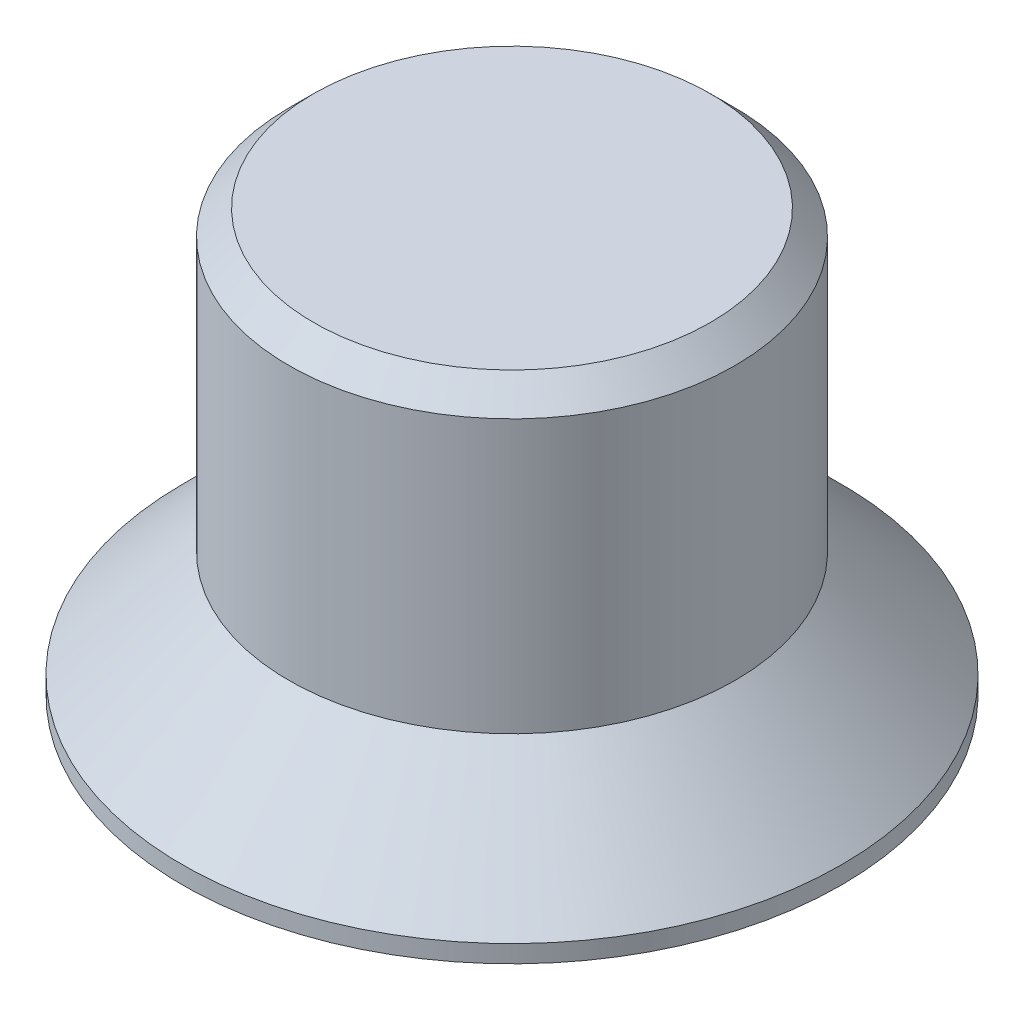
ISO-10303-21;
HEADER;
FILE_DESCRIPTION(('STEP AP214'),'2;1');
FILE_NAME('part.step','',(''),(''),'','','');
FILE_SCHEMA(('AUTOMOTIVE_DESIGN { 1 0 10303 214 1 1 1 1 }'));
ENDSEC;
DATA;
#1=APPLICATION_CONTEXT('core data for automotive mechanical design processes');
#2=APPLICATION_PROTOCOL_DEFINITION('international standard','automotive_design',2000,#1);
#3=PRODUCT_CONTEXT('',#1,'mechanical');
#4=PRODUCT('Part','Part','',(#3));
#5=PRODUCT_RELATED_PRODUCT_CATEGORY('part','',(#4));
#6=PRODUCT_DEFINITION_FORMATION('','',#4);
#7=PRODUCT_DEFINITION_CONTEXT('part definition',#1,'design');
#8=PRODUCT_DEFINITION('design','',#6,#7);
#9=PRODUCT_DEFINITION_SHAPE('','',#8);
#10=(LENGTH_UNIT() NAMED_UNIT(*) SI_UNIT(.MILLI.,.METRE.));
#11=(NAMED_UNIT(*) PLANE_ANGLE_UNIT() SI_UNIT($,.RADIAN.));
#12=(NAMED_UNIT(*) SI_UNIT($,.STERADIAN.) SOLID_ANGLE_UNIT());
#13=UNCERTAINTY_MEASURE_WITH_UNIT(LENGTH_MEASURE(1.E-05),#10,'distance_accuracy_value','');
#14=(GEOMETRIC_REPRESENTATION_CONTEXT(3) GLOBAL_UNCERTAINTY_ASSIGNED_CONTEXT((#13)) GLOBAL_UNIT_ASSIGNED_CONTEXT((#10,
#11,#12)) REPRESENTATION_CONTEXT('',''));
#15=CARTESIAN_POINT('',(0.,0.,0.));
#16=DIRECTION('',(0.,0.,1.));
#17=DIRECTION('',(1.,0.,0.));
#18=AXIS2_PLACEMENT_3D('',#15,#16,#17);
#19=CARTESIAN_POINT('',(0.,0.249999999999997,0.));
#20=DIRECTION('',(0.,-1.,0.));
#21=DIRECTION('',(1.,0.,0.));
#22=AXIS2_PLACEMENT_3D('',#19,#20,#21);
#23=PLANE('',#22);
#24=CARTESIAN_POINT('',(0.,0.249999999999972,0.));
#25=DIRECTION('',(0.,-1.,0.));
#26=DIRECTION('',(1.,0.,0.));
#27=AXIS2_PLACEMENT_3D('',#24,#25,#26);
#28=CIRCLE('',#27,1.5);
#29=CARTESIAN_POINT('',(1.5,0.249999999999978,0.));
#30=VERTEX_POINT('',#29);
#31=EDGE_CURVE('E54',#30,#30,#28,.T.);
#32=ORIENTED_EDGE('',*,*,#31,.T.);
#33=EDGE_LOOP('',(#32));
#34=FACE_BOUND('',#33,.T.);
#35=ADVANCED_FACE('F33',(#34),#23,.T.);
#36=CARTESIAN_POINT('',(0.,0.249999999999972,0.));
#37=DIRECTION('',(0.,-1.,0.));
#38=DIRECTION('',(1.,0.,0.));
#39=AXIS2_PLACEMENT_3D('',#36,#37,#38);
#40=CONICAL_SURFACE('',#39,1.5,0.174532925199445);
#41=CARTESIAN_POINT('',(0.,0.,0.));
#42=DIRECTION('',(0.,-1.,0.));
#43=DIRECTION('',(1.,0.,0.));
#44=AXIS2_PLACEMENT_3D('',#41,#42,#43);
#45=CIRCLE('',#44,1.54408174517712);
#46=CARTESIAN_POINT('',(1.54408174517712,0.,0.));
#47=VERTEX_POINT('',#46);
#48=EDGE_CURVE('E57',#47,#47,#45,.T.);
#49=ORIENTED_EDGE('',*,*,#48,.T.);
#50=EDGE_LOOP('',(#49));
#51=FACE_BOUND('',#50,.T.);
#52=ORIENTED_EDGE('',*,*,#31,.F.);
#53=EDGE_LOOP('',(#52));
#54=FACE_BOUND('',#53,.T.);
#55=ADVANCED_FACE('F81',(#51,#54),#40,.F.);
#56=CARTESIAN_POINT('',(1.54408174517712,0.,0.));
#57=DIRECTION('',(0.,-1.,0.));
#58=DIRECTION('',(1.,0.,0.));
#59=AXIS2_PLACEMENT_3D('',#56,#57,#58);
#60=PLANE('',#59);
#61=CARTESIAN_POINT('',(0.,0.,0.));
#62=DIRECTION('',(0.,-1.,0.));
#63=DIRECTION('',(1.,0.,0.));
#64=AXIS2_PLACEMENT_3D('',#61,#62,#63);
#65=CIRCLE('',#64,3.32322330470336);
#66=CARTESIAN_POINT('',(3.32322330470336,0.,0.));
#67=VERTEX_POINT('',#66);
#68=EDGE_CURVE('E41',#67,#67,#65,.T.);
#69=ORIENTED_EDGE('',*,*,#68,.T.);
#70=EDGE_LOOP('',(#69));
#71=FACE_BOUND('',#70,.T.);
#72=ORIENTED_EDGE('',*,*,#48,.F.);
#73=EDGE_LOOP('',(#72));
#74=FACE_BOUND('',#73,.T.);
#75=ADVANCED_FACE('F78',(#71,#74),#60,.T.);
#76=CARTESIAN_POINT('',(0.,0.,0.));
#77=DIRECTION('',(0.,-1.,0.));
#78=DIRECTION('',(1.,0.,0.));
#79=AXIS2_PLACEMENT_3D('',#76,#77,#78);
#80=CONICAL_SURFACE('',#79,3.5,0.785398163397449);
#81=CARTESIAN_POINT('',(0.,0.176776695296639,0.));
#82=DIRECTION('',(0.,1.,0.));
#83=DIRECTION('',(-1.,0.,0.));
#84=AXIS2_PLACEMENT_3D('',#81,#82,#83);
#85=CIRCLE('',#84,3.32322330470336);
#86=CARTESIAN_POINT('',(-3.32322330470336,0.176776695296627,0.));
#87=VERTEX_POINT('',#86);
#88=EDGE_CURVE('E10',#87,#87,#85,.T.);
#89=ORIENTED_EDGE('',*,*,#88,.T.);
#90=EDGE_LOOP('',(#89));
#91=FACE_BOUND('',#90,.T.);
#92=CARTESIAN_POINT('',(0.,1.25000000000003,0.));
#93=DIRECTION('',(0.,-1.,0.));
#94=DIRECTION('',(1.,0.,0.));
#95=AXIS2_PLACEMENT_3D('',#92,#93,#94);
#96=CIRCLE('',#95,2.24999999999997);
#97=CARTESIAN_POINT('',(2.24999999999997,1.25000000000004,0.));
#98=VERTEX_POINT('',#97);
#99=EDGE_CURVE('E60',#98,#98,#96,.T.);
#100=ORIENTED_EDGE('',*,*,#99,.T.);
#101=EDGE_LOOP('',(#100));
#102=FACE_BOUND('',#101,.T.);
#103=ADVANCED_FACE('F64',(#91,#102),#80,.T.);
#104=CARTESIAN_POINT('',(9.52916523253569E-13,-277.798061762601,0.));
#105=DIRECTION('',(0.,-1.,0.));
#106=DIRECTION('',(1.,0.,0.));
#107=AXIS2_PLACEMENT_3D('',#104,#105,#106);
#108=CYLINDRICAL_SURFACE('',#107,2.24999999999997);
#109=CARTESIAN_POINT('',(0.,4.00000000000006,0.));
#110=DIRECTION('',(0.,1.,0.));
#111=DIRECTION('',(-1.,0.,0.));
#112=AXIS2_PLACEMENT_3D('',#109,#110,#111);
#113=CIRCLE('',#112,2.24999999999997);
#114=CARTESIAN_POINT('',(-2.24999999999999,4.00000000000005,0.));
#115=VERTEX_POINT('',#114);
#116=EDGE_CURVE('E49',#115,#115,#113,.F.);
#117=ORIENTED_EDGE('',*,*,#116,.T.);
#118=EDGE_LOOP('',(#117));
#119=FACE_BOUND('',#118,.T.);
#120=ORIENTED_EDGE('',*,*,#99,.F.);
#121=EDGE_LOOP('',(#120));
#122=FACE_BOUND('',#121,.T.);
#123=ADVANCED_FACE('F66',(#119,#122),#108,.T.);
#124=CARTESIAN_POINT('',(2.24999999999996,4.25000000000005,0.));
#125=DIRECTION('',(0.,1.,0.));
#126=DIRECTION('',(-1.,0.,0.));
#127=AXIS2_PLACEMENT_3D('',#124,#125,#126);
#128=PLANE('',#127);
#129=CARTESIAN_POINT('',(0.,4.25000000000004,0.));
#130=DIRECTION('',(0.,1.,0.));
#131=DIRECTION('',(-1.,0.,0.));
#132=AXIS2_PLACEMENT_3D('',#129,#130,#131);
#133=CIRCLE('',#132,1.99999999999996);
#134=CARTESIAN_POINT('',(-1.99999999999998,4.25000000000004,0.));
#135=VERTEX_POINT('',#134);
#136=EDGE_CURVE('E45',#135,#135,#133,.T.);
#137=ORIENTED_EDGE('',*,*,#136,.T.);
#138=EDGE_LOOP('',(#137));
#139=FACE_BOUND('',#138,.T.);
#140=ADVANCED_FACE('F68',(#139),#128,.T.);
#141=CARTESIAN_POINT('',(0.,4.00000000000006,0.));
#142=DIRECTION('',(0.,-1.,0.));
#143=DIRECTION('',(1.,0.,0.));
#144=AXIS2_PLACEMENT_3D('',#141,#142,#143);
#145=CONICAL_SURFACE('',#144,2.24999999999997,0.785398163397508);
#146=ORIENTED_EDGE('',*,*,#136,.F.);
#147=EDGE_LOOP('',(#146));
#148=FACE_BOUND('',#147,.T.);
#149=ORIENTED_EDGE('',*,*,#116,.F.);
#150=EDGE_LOOP('',(#149));
#151=FACE_BOUND('',#150,.T.);
#152=ADVANCED_FACE('F75',(#148,#151),#145,.T.);
#153=CARTESIAN_POINT('',(0.,0.,0.));
#154=DIRECTION('',(0.,-1.,0.));
#155=DIRECTION('',(1.,0.,0.));
#156=AXIS2_PLACEMENT_3D('',#153,#154,#155);
#157=CYLINDRICAL_SURFACE('',#156,3.32322330470336);
#158=ORIENTED_EDGE('',*,*,#88,.F.);
#159=EDGE_LOOP('',(#158));
#160=FACE_BOUND('',#159,.T.);
#161=ORIENTED_EDGE('',*,*,#68,.F.);
#162=EDGE_LOOP('',(#161));
#163=FACE_BOUND('',#162,.T.);
#164=ADVANCED_FACE('F36',(#160,#163),#157,.T.);
#165=CLOSED_SHELL('',(#35,#55,#75,#103,#123,#140,#152,#164));
#166=MANIFOLD_SOLID_BREP('B2',#165);
#167=ADVANCED_BREP_SHAPE_REPRESENTATION('',(#18,#166),#14);
#168=SHAPE_DEFINITION_REPRESENTATION(#9,#167);
ENDSEC;
END-ISO-10303-21;
